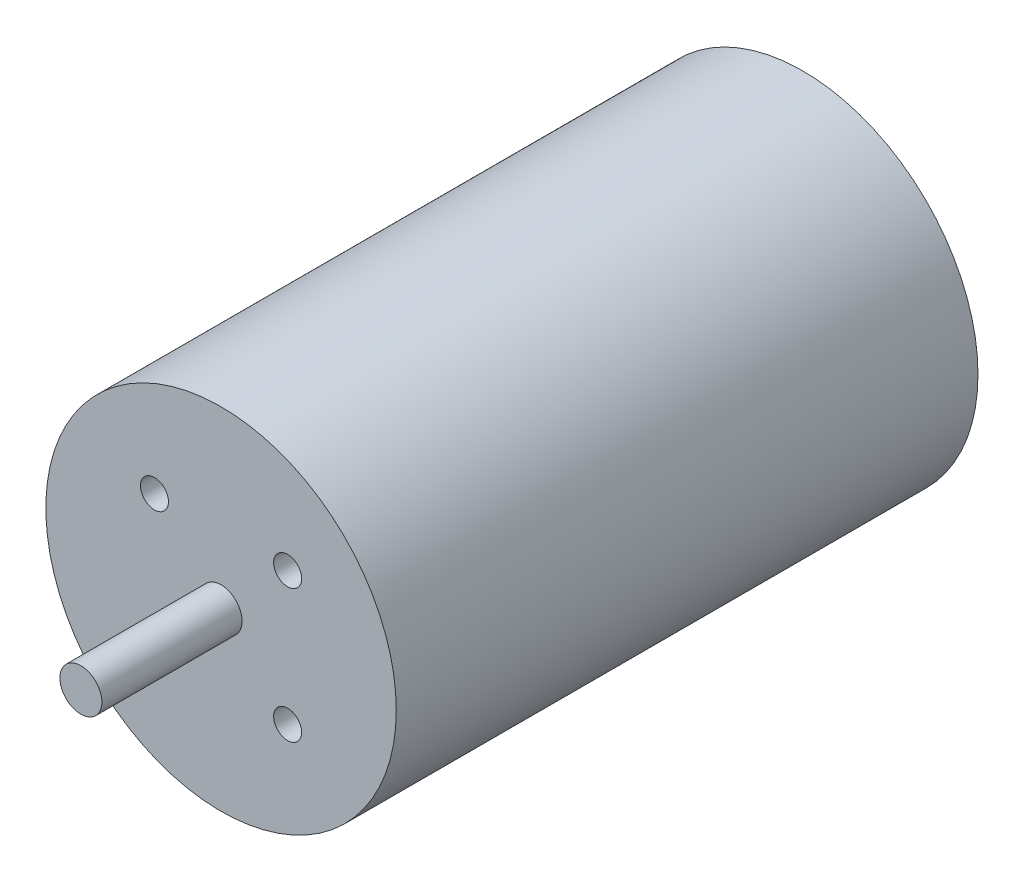
ISO-10303-21;
HEADER;
FILE_DESCRIPTION(('STEP AP214'),'2;1');
FILE_NAME('part.step','',(''),(''),'','','');
FILE_SCHEMA(('AUTOMOTIVE_DESIGN { 1 0 10303 214 1 1 1 1 }'));
ENDSEC;
DATA;
#1=APPLICATION_CONTEXT('core data for automotive mechanical design processes');
#2=APPLICATION_PROTOCOL_DEFINITION('international standard','automotive_design',2000,#1);
#3=PRODUCT_CONTEXT('',#1,'mechanical');
#4=PRODUCT('Part','Part','',(#3));
#5=PRODUCT_RELATED_PRODUCT_CATEGORY('part','',(#4));
#6=PRODUCT_DEFINITION_FORMATION('','',#4);
#7=PRODUCT_DEFINITION_CONTEXT('part definition',#1,'design');
#8=PRODUCT_DEFINITION('design','',#6,#7);
#9=PRODUCT_DEFINITION_SHAPE('','',#8);
#10=(LENGTH_UNIT() NAMED_UNIT(*) SI_UNIT(.MILLI.,.METRE.));
#11=(NAMED_UNIT(*) PLANE_ANGLE_UNIT() SI_UNIT($,.RADIAN.));
#12=(NAMED_UNIT(*) SI_UNIT($,.STERADIAN.) SOLID_ANGLE_UNIT());
#13=UNCERTAINTY_MEASURE_WITH_UNIT(LENGTH_MEASURE(1.E-05),#10,'distance_accuracy_value','');
#14=(GEOMETRIC_REPRESENTATION_CONTEXT(3) GLOBAL_UNCERTAINTY_ASSIGNED_CONTEXT((#13)) GLOBAL_UNIT_ASSIGNED_CONTEXT((#10,
#11,#12)) REPRESENTATION_CONTEXT('',''));
#15=CARTESIAN_POINT('',(0.,0.,0.));
#16=DIRECTION('',(0.,0.,1.));
#17=DIRECTION('',(1.,0.,0.));
#18=AXIS2_PLACEMENT_3D('',#15,#16,#17);
#19=CARTESIAN_POINT('',(0.,0.,83.));
#20=DIRECTION('',(0.,0.,-1.));
#21=DIRECTION('',(-1.,0.,0.));
#22=AXIS2_PLACEMENT_3D('',#19,#20,#21);
#23=CYLINDRICAL_SURFACE('',#22,25.);
#24=CARTESIAN_POINT('',(0.,0.,83.));
#25=DIRECTION('',(0.,0.,1.));
#26=DIRECTION('',(1.,0.,0.));
#27=AXIS2_PLACEMENT_3D('',#24,#25,#26);
#28=CIRCLE('',#27,25.);
#29=CARTESIAN_POINT('',(25.,0.,83.));
#30=VERTEX_POINT('',#29);
#31=EDGE_CURVE('E10',#30,#30,#28,.T.);
#32=ORIENTED_EDGE('',*,*,#31,.F.);
#33=EDGE_LOOP('',(#32));
#34=FACE_BOUND('',#33,.T.);
#35=CARTESIAN_POINT('',(0.,0.,0.));
#36=DIRECTION('',(0.,0.,1.));
#37=DIRECTION('',(1.,0.,0.));
#38=AXIS2_PLACEMENT_3D('',#35,#36,#37);
#39=CIRCLE('',#38,25.);
#40=CARTESIAN_POINT('',(25.,0.,0.));
#41=VERTEX_POINT('',#40);
#42=EDGE_CURVE('E40',#41,#41,#39,.T.);
#43=ORIENTED_EDGE('',*,*,#42,.T.);
#44=EDGE_LOOP('',(#43));
#45=FACE_BOUND('',#44,.T.);
#46=ADVANCED_FACE('F37',(#34,#45),#23,.T.);
#47=CARTESIAN_POINT('',(0.,0.,83.));
#48=DIRECTION('',(0.,0.,1.));
#49=DIRECTION('',(1.,0.,0.));
#50=AXIS2_PLACEMENT_3D('',#47,#48,#49);
#51=PLANE('',#50);
#52=CARTESIAN_POINT('',(9.5,9.50000000002979,83.));
#53=DIRECTION('',(0.,0.,1.));
#54=DIRECTION('',(1.,0.,0.));
#55=AXIS2_PLACEMENT_3D('',#52,#53,#54);
#56=CIRCLE('',#55,2.);
#57=CARTESIAN_POINT('',(11.5,9.50000000002979,83.));
#58=VERTEX_POINT('',#57);
#59=EDGE_CURVE('E67',#58,#58,#56,.T.);
#60=ORIENTED_EDGE('',*,*,#59,.F.);
#61=EDGE_LOOP('',(#60));
#62=FACE_BOUND('',#61,.T.);
#63=CARTESIAN_POINT('',(9.5,-9.49999999997021,83.));
#64=DIRECTION('',(0.,0.,1.));
#65=DIRECTION('',(1.,0.,0.));
#66=AXIS2_PLACEMENT_3D('',#63,#64,#65);
#67=CIRCLE('',#66,2.);
#68=CARTESIAN_POINT('',(11.5,-9.49999999997021,83.));
#69=VERTEX_POINT('',#68);
#70=EDGE_CURVE('E75',#69,#69,#67,.T.);
#71=ORIENTED_EDGE('',*,*,#70,.F.);
#72=EDGE_LOOP('',(#71));
#73=FACE_BOUND('',#72,.T.);
#74=CARTESIAN_POINT('',(-9.5,-9.49999999997021,83.));
#75=DIRECTION('',(0.,0.,1.));
#76=DIRECTION('',(1.,0.,0.));
#77=AXIS2_PLACEMENT_3D('',#74,#75,#76);
#78=CIRCLE('',#77,2.);
#79=CARTESIAN_POINT('',(-7.5,-9.49999999997021,83.));
#80=VERTEX_POINT('',#79);
#81=EDGE_CURVE('E83',#80,#80,#78,.T.);
#82=ORIENTED_EDGE('',*,*,#81,.F.);
#83=EDGE_LOOP('',(#82));
#84=FACE_BOUND('',#83,.T.);
#85=CARTESIAN_POINT('',(-9.5,9.50000000002978,83.));
#86=DIRECTION('',(0.,0.,1.));
#87=DIRECTION('',(1.,0.,0.));
#88=AXIS2_PLACEMENT_3D('',#85,#86,#87);
#89=CIRCLE('',#88,2.);
#90=CARTESIAN_POINT('',(-7.5,9.50000000002978,83.));
#91=VERTEX_POINT('',#90);
#92=EDGE_CURVE('E59',#91,#91,#89,.T.);
#93=ORIENTED_EDGE('',*,*,#92,.F.);
#94=EDGE_LOOP('',(#93));
#95=FACE_BOUND('',#94,.T.);
#96=CARTESIAN_POINT('',(0.,0.,83.));
#97=DIRECTION('',(0.,0.,1.));
#98=DIRECTION('',(1.,0.,0.));
#99=AXIS2_PLACEMENT_3D('',#96,#97,#98);
#100=CIRCLE('',#99,3.);
#101=CARTESIAN_POINT('',(3.,0.,83.));
#102=VERTEX_POINT('',#101);
#103=EDGE_CURVE('E51',#102,#102,#100,.T.);
#104=ORIENTED_EDGE('',*,*,#103,.F.);
#105=EDGE_LOOP('',(#104));
#106=FACE_BOUND('',#105,.T.);
#107=ORIENTED_EDGE('',*,*,#31,.T.);
#108=EDGE_LOOP('',(#107));
#109=FACE_BOUND('',#108,.T.);
#110=ADVANCED_FACE('F100',(#62,#73,#84,#95,#106,#109),#51,.T.);
#111=CARTESIAN_POINT('',(0.,0.,0.));
#112=DIRECTION('',(0.,0.,1.));
#113=DIRECTION('',(1.,0.,0.));
#114=AXIS2_PLACEMENT_3D('',#111,#112,#113);
#115=PLANE('',#114);
#116=ORIENTED_EDGE('',*,*,#42,.F.);
#117=EDGE_LOOP('',(#116));
#118=FACE_BOUND('',#117,.T.);
#119=ADVANCED_FACE('F103',(#118),#115,.F.);
#120=CARTESIAN_POINT('',(0.,0.,103.));
#121=DIRECTION('',(0.,0.,-1.));
#122=DIRECTION('',(-1.,0.,0.));
#123=AXIS2_PLACEMENT_3D('',#120,#121,#122);
#124=CYLINDRICAL_SURFACE('',#123,3.);
#125=CARTESIAN_POINT('',(0.,0.,103.));
#126=DIRECTION('',(0.,0.,1.));
#127=DIRECTION('',(1.,0.,0.));
#128=AXIS2_PLACEMENT_3D('',#125,#126,#127);
#129=CIRCLE('',#128,3.);
#130=CARTESIAN_POINT('',(3.,0.,103.));
#131=VERTEX_POINT('',#130);
#132=EDGE_CURVE('E49',#131,#131,#129,.T.);
#133=ORIENTED_EDGE('',*,*,#132,.F.);
#134=EDGE_LOOP('',(#133));
#135=FACE_BOUND('',#134,.T.);
#136=ORIENTED_EDGE('',*,*,#103,.T.);
#137=EDGE_LOOP('',(#136));
#138=FACE_BOUND('',#137,.T.);
#139=ADVANCED_FACE('F110',(#135,#138),#124,.T.);
#140=CARTESIAN_POINT('',(0.,0.,103.));
#141=DIRECTION('',(0.,0.,1.));
#142=DIRECTION('',(1.,0.,0.));
#143=AXIS2_PLACEMENT_3D('',#140,#141,#142);
#144=PLANE('',#143);
#145=ORIENTED_EDGE('',*,*,#132,.T.);
#146=EDGE_LOOP('',(#145));
#147=FACE_BOUND('',#146,.T.);
#148=ADVANCED_FACE('F112',(#147),#144,.T.);
#149=CARTESIAN_POINT('',(-9.5,9.50000000002978,73.));
#150=DIRECTION('',(0.,0.,1.));
#151=DIRECTION('',(1.,0.,0.));
#152=AXIS2_PLACEMENT_3D('',#149,#150,#151);
#153=CYLINDRICAL_SURFACE('',#152,2.);
#154=CARTESIAN_POINT('',(-9.5,9.50000000002978,73.));
#155=DIRECTION('',(0.,0.,1.));
#156=DIRECTION('',(1.,0.,0.));
#157=AXIS2_PLACEMENT_3D('',#154,#155,#156);
#158=CIRCLE('',#157,2.);
#159=CARTESIAN_POINT('',(-7.5,9.50000000002978,73.));
#160=VERTEX_POINT('',#159);
#161=EDGE_CURVE('E55',#160,#160,#158,.T.);
#162=ORIENTED_EDGE('',*,*,#161,.F.);
#163=EDGE_LOOP('',(#162));
#164=FACE_BOUND('',#163,.T.);
#165=ORIENTED_EDGE('',*,*,#92,.T.);
#166=EDGE_LOOP('',(#165));
#167=FACE_BOUND('',#166,.T.);
#168=ADVANCED_FACE('F119',(#164,#167),#153,.F.);
#169=CARTESIAN_POINT('',(-9.5,9.50000000002978,73.));
#170=DIRECTION('',(0.,0.,1.));
#171=DIRECTION('',(1.,0.,0.));
#172=AXIS2_PLACEMENT_3D('',#169,#170,#171);
#173=PLANE('',#172);
#174=ORIENTED_EDGE('',*,*,#161,.T.);
#175=EDGE_LOOP('',(#174));
#176=FACE_BOUND('',#175,.T.);
#177=ADVANCED_FACE('F96',(#176),#173,.T.);
#178=CARTESIAN_POINT('',(-9.5,-9.49999999997021,73.));
#179=DIRECTION('',(0.,0.,1.));
#180=DIRECTION('',(1.,0.,0.));
#181=AXIS2_PLACEMENT_3D('',#178,#179,#180);
#182=CYLINDRICAL_SURFACE('',#181,2.);
#183=CARTESIAN_POINT('',(-9.5,-9.49999999997021,73.));
#184=DIRECTION('',(0.,0.,1.));
#185=DIRECTION('',(1.,0.,0.));
#186=AXIS2_PLACEMENT_3D('',#183,#184,#185);
#187=CIRCLE('',#186,2.);
#188=CARTESIAN_POINT('',(-7.5,-9.49999999997021,73.));
#189=VERTEX_POINT('',#188);
#190=EDGE_CURVE('E63',#189,#189,#187,.T.);
#191=ORIENTED_EDGE('',*,*,#190,.F.);
#192=EDGE_LOOP('',(#191));
#193=FACE_BOUND('',#192,.T.);
#194=ORIENTED_EDGE('',*,*,#81,.T.);
#195=EDGE_LOOP('',(#194));
#196=FACE_BOUND('',#195,.T.);
#197=ADVANCED_FACE('F93',(#193,#196),#182,.F.);
#198=CARTESIAN_POINT('',(-9.5,-9.49999999997021,73.));
#199=DIRECTION('',(0.,0.,1.));
#200=DIRECTION('',(1.,0.,0.));
#201=AXIS2_PLACEMENT_3D('',#198,#199,#200);
#202=PLANE('',#201);
#203=ORIENTED_EDGE('',*,*,#190,.T.);
#204=EDGE_LOOP('',(#203));
#205=FACE_BOUND('',#204,.T.);
#206=ADVANCED_FACE('F91',(#205),#202,.T.);
#207=CARTESIAN_POINT('',(9.5,-9.49999999997021,73.));
#208=DIRECTION('',(0.,0.,1.));
#209=DIRECTION('',(1.,0.,0.));
#210=AXIS2_PLACEMENT_3D('',#207,#208,#209);
#211=CYLINDRICAL_SURFACE('',#210,2.);
#212=CARTESIAN_POINT('',(9.5,-9.49999999997021,73.));
#213=DIRECTION('',(0.,0.,1.));
#214=DIRECTION('',(1.,0.,0.));
#215=AXIS2_PLACEMENT_3D('',#212,#213,#214);
#216=CIRCLE('',#215,2.);
#217=CARTESIAN_POINT('',(11.5,-9.49999999997021,73.));
#218=VERTEX_POINT('',#217);
#219=EDGE_CURVE('E79',#218,#218,#216,.T.);
#220=ORIENTED_EDGE('',*,*,#219,.F.);
#221=EDGE_LOOP('',(#220));
#222=FACE_BOUND('',#221,.T.);
#223=ORIENTED_EDGE('',*,*,#70,.T.);
#224=EDGE_LOOP('',(#223));
#225=FACE_BOUND('',#224,.T.);
#226=ADVANCED_FACE('F174',(#222,#225),#211,.F.);
#227=CARTESIAN_POINT('',(9.5,-9.49999999997021,73.));
#228=DIRECTION('',(0.,0.,1.));
#229=DIRECTION('',(1.,0.,0.));
#230=AXIS2_PLACEMENT_3D('',#227,#228,#229);
#231=PLANE('',#230);
#232=ORIENTED_EDGE('',*,*,#219,.T.);
#233=EDGE_LOOP('',(#232));
#234=FACE_BOUND('',#233,.T.);
#235=ADVANCED_FACE('F181',(#234),#231,.T.);
#236=CARTESIAN_POINT('',(9.5,9.50000000002979,73.));
#237=DIRECTION('',(0.,0.,1.));
#238=DIRECTION('',(1.,0.,0.));
#239=AXIS2_PLACEMENT_3D('',#236,#237,#238);
#240=CYLINDRICAL_SURFACE('',#239,2.);
#241=CARTESIAN_POINT('',(9.5,9.50000000002979,73.));
#242=DIRECTION('',(0.,0.,1.));
#243=DIRECTION('',(1.,0.,0.));
#244=AXIS2_PLACEMENT_3D('',#241,#242,#243);
#245=CIRCLE('',#244,2.);
#246=CARTESIAN_POINT('',(11.5,9.50000000002979,73.));
#247=VERTEX_POINT('',#246);
#248=EDGE_CURVE('E71',#247,#247,#245,.T.);
#249=ORIENTED_EDGE('',*,*,#248,.F.);
#250=EDGE_LOOP('',(#249));
#251=FACE_BOUND('',#250,.T.);
#252=ORIENTED_EDGE('',*,*,#59,.T.);
#253=EDGE_LOOP('',(#252));
#254=FACE_BOUND('',#253,.T.);
#255=ADVANCED_FACE('F189',(#251,#254),#240,.F.);
#256=CARTESIAN_POINT('',(9.5,9.50000000002979,73.));
#257=DIRECTION('',(0.,0.,1.));
#258=DIRECTION('',(1.,0.,0.));
#259=AXIS2_PLACEMENT_3D('',#256,#257,#258);
#260=PLANE('',#259);
#261=ORIENTED_EDGE('',*,*,#248,.T.);
#262=EDGE_LOOP('',(#261));
#263=FACE_BOUND('',#262,.T.);
#264=ADVANCED_FACE('F197',(#263),#260,.T.);
#265=CLOSED_SHELL('',(#46,#110,#119,#139,#148,#168,#177,#197,#206,#226,#235,#255,#264));
#266=MANIFOLD_SOLID_BREP('B2',#265);
#267=ADVANCED_BREP_SHAPE_REPRESENTATION('',(#18,#266),#14);
#268=SHAPE_DEFINITION_REPRESENTATION(#9,#267);
ENDSEC;
END-ISO-10303-21;
